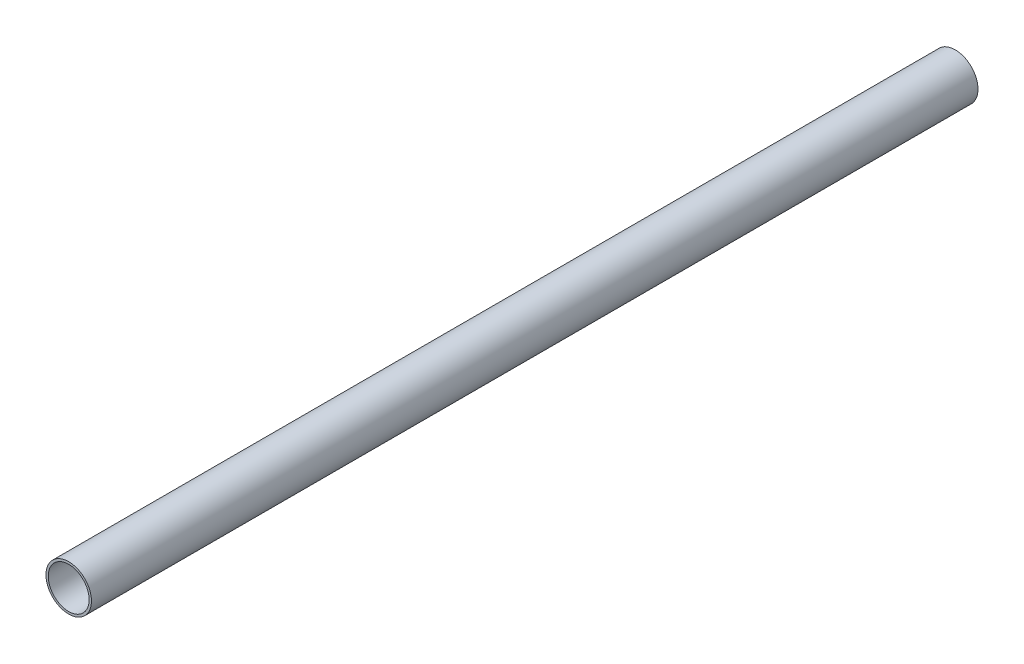
ISO-10303-21;
HEADER;
FILE_DESCRIPTION(('STEP AP214'),'2;1');
FILE_NAME('part.step','',(''),(''),'','','');
FILE_SCHEMA(('AUTOMOTIVE_DESIGN { 1 0 10303 214 1 1 1 1 }'));
ENDSEC;
DATA;
#1=APPLICATION_CONTEXT('core data for automotive mechanical design processes');
#2=APPLICATION_PROTOCOL_DEFINITION('international standard','automotive_design',2000,#1);
#3=PRODUCT_CONTEXT('',#1,'mechanical');
#4=PRODUCT('Part','Part','',(#3));
#5=PRODUCT_RELATED_PRODUCT_CATEGORY('part','',(#4));
#6=PRODUCT_DEFINITION_FORMATION('','',#4);
#7=PRODUCT_DEFINITION_CONTEXT('part definition',#1,'design');
#8=PRODUCT_DEFINITION('design','',#6,#7);
#9=PRODUCT_DEFINITION_SHAPE('','',#8);
#10=(LENGTH_UNIT() NAMED_UNIT(*) SI_UNIT(.MILLI.,.METRE.));
#11=(NAMED_UNIT(*) PLANE_ANGLE_UNIT() SI_UNIT($,.RADIAN.));
#12=(NAMED_UNIT(*) SI_UNIT($,.STERADIAN.) SOLID_ANGLE_UNIT());
#13=UNCERTAINTY_MEASURE_WITH_UNIT(LENGTH_MEASURE(1.E-05),#10,'distance_accuracy_value','');
#14=(GEOMETRIC_REPRESENTATION_CONTEXT(3) GLOBAL_UNCERTAINTY_ASSIGNED_CONTEXT((#13)) GLOBAL_UNIT_ASSIGNED_CONTEXT((#10,
#11,#12)) REPRESENTATION_CONTEXT('',''));
#15=CARTESIAN_POINT('',(0.,0.,0.));
#16=DIRECTION('',(0.,0.,1.));
#17=DIRECTION('',(1.,0.,0.));
#18=AXIS2_PLACEMENT_3D('',#15,#16,#17);
#19=CARTESIAN_POINT('',(0.,0.,97.5));
#20=DIRECTION('',(0.,0.,1.));
#21=DIRECTION('',(1.,0.,0.));
#22=AXIS2_PLACEMENT_3D('',#19,#20,#21);
#23=PLANE('',#22);
#24=CARTESIAN_POINT('',(0.,0.,97.5));
#25=DIRECTION('',(0.,0.,1.));
#26=DIRECTION('',(1.,0.,0.));
#27=AXIS2_PLACEMENT_3D('',#24,#25,#26);
#28=CIRCLE('',#27,5.);
#29=CARTESIAN_POINT('',(5.,0.,97.5));
#30=VERTEX_POINT('',#29);
#31=EDGE_CURVE('E10',#30,#30,#28,.T.);
#32=ORIENTED_EDGE('',*,*,#31,.T.);
#33=EDGE_LOOP('',(#32));
#34=FACE_BOUND('',#33,.T.);
#35=CARTESIAN_POINT('',(0.,0.,97.5));
#36=DIRECTION('',(0.,0.,1.));
#37=DIRECTION('',(1.,0.,0.));
#38=AXIS2_PLACEMENT_3D('',#35,#36,#37);
#39=CIRCLE('',#38,4.5);
#40=CARTESIAN_POINT('',(4.5,0.,97.5));
#41=VERTEX_POINT('',#40);
#42=EDGE_CURVE('E50',#41,#41,#39,.T.);
#43=ORIENTED_EDGE('',*,*,#42,.F.);
#44=EDGE_LOOP('',(#43));
#45=FACE_BOUND('',#44,.T.);
#46=ADVANCED_FACE('F37',(#34,#45),#23,.T.);
#47=CARTESIAN_POINT('',(0.,0.,-97.5));
#48=DIRECTION('',(0.,0.,1.));
#49=DIRECTION('',(1.,0.,0.));
#50=AXIS2_PLACEMENT_3D('',#47,#48,#49);
#51=PLANE('',#50);
#52=CARTESIAN_POINT('',(0.,0.,-97.5));
#53=DIRECTION('',(0.,0.,1.));
#54=DIRECTION('',(1.,0.,0.));
#55=AXIS2_PLACEMENT_3D('',#52,#53,#54);
#56=CIRCLE('',#55,5.);
#57=CARTESIAN_POINT('',(5.,0.,-97.5));
#58=VERTEX_POINT('',#57);
#59=EDGE_CURVE('E41',#58,#58,#56,.T.);
#60=ORIENTED_EDGE('',*,*,#59,.F.);
#61=EDGE_LOOP('',(#60));
#62=FACE_BOUND('',#61,.T.);
#63=CARTESIAN_POINT('',(0.,0.,-97.5));
#64=DIRECTION('',(0.,0.,1.));
#65=DIRECTION('',(1.,0.,0.));
#66=AXIS2_PLACEMENT_3D('',#63,#64,#65);
#67=CIRCLE('',#66,4.5);
#68=CARTESIAN_POINT('',(4.5,0.,-97.5));
#69=VERTEX_POINT('',#68);
#70=EDGE_CURVE('E52',#69,#69,#67,.T.);
#71=ORIENTED_EDGE('',*,*,#70,.T.);
#72=EDGE_LOOP('',(#71));
#73=FACE_BOUND('',#72,.T.);
#74=ADVANCED_FACE('F64',(#62,#73),#51,.F.);
#75=CARTESIAN_POINT('',(0.,0.,97.5));
#76=DIRECTION('',(0.,0.,-1.));
#77=DIRECTION('',(-1.,0.,0.));
#78=AXIS2_PLACEMENT_3D('',#75,#76,#77);
#79=CYLINDRICAL_SURFACE('',#78,5.);
#80=ORIENTED_EDGE('',*,*,#31,.F.);
#81=EDGE_LOOP('',(#80));
#82=FACE_BOUND('',#81,.T.);
#83=ORIENTED_EDGE('',*,*,#59,.T.);
#84=EDGE_LOOP('',(#83));
#85=FACE_BOUND('',#84,.T.);
#86=ADVANCED_FACE('F39',(#82,#85),#79,.T.);
#87=CARTESIAN_POINT('',(0.,0.,97.5));
#88=DIRECTION('',(0.,0.,-1.));
#89=DIRECTION('',(-1.,0.,0.));
#90=AXIS2_PLACEMENT_3D('',#87,#88,#89);
#91=CYLINDRICAL_SURFACE('',#90,4.5);
#92=ORIENTED_EDGE('',*,*,#42,.T.);
#93=EDGE_LOOP('',(#92));
#94=FACE_BOUND('',#93,.T.);
#95=ORIENTED_EDGE('',*,*,#70,.F.);
#96=EDGE_LOOP('',(#95));
#97=FACE_BOUND('',#96,.T.);
#98=ADVANCED_FACE('F60',(#94,#97),#91,.F.);
#99=CLOSED_SHELL('',(#46,#74,#86,#98));
#100=MANIFOLD_SOLID_BREP('B2',#99);
#101=ADVANCED_BREP_SHAPE_REPRESENTATION('',(#18,#100),#14);
#102=SHAPE_DEFINITION_REPRESENTATION(#9,#101);
ENDSEC;
END-ISO-10303-21;
